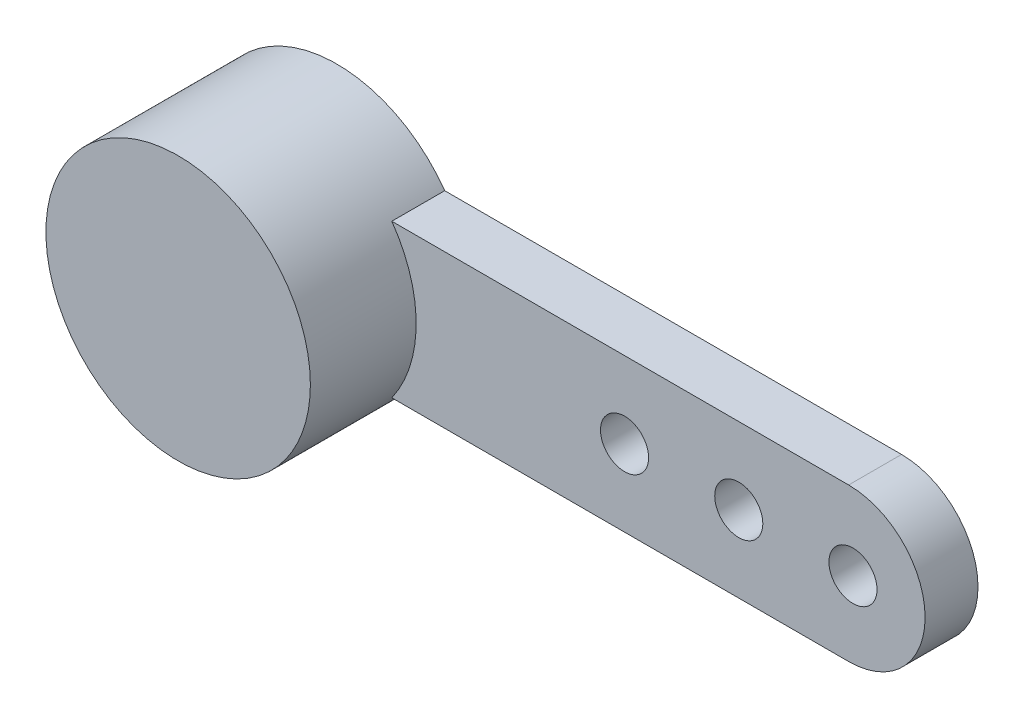
ISO-10303-21;
HEADER;
FILE_DESCRIPTION(('STEP AP214'),'2;1');
FILE_NAME('part.step','',(''),(''),'','','');
FILE_SCHEMA(('AUTOMOTIVE_DESIGN { 1 0 10303 214 1 1 1 1 }'));
ENDSEC;
DATA;
#1=APPLICATION_CONTEXT('core data for automotive mechanical design processes');
#2=APPLICATION_PROTOCOL_DEFINITION('international standard','automotive_design',2000,#1);
#3=PRODUCT_CONTEXT('',#1,'mechanical');
#4=PRODUCT('Part','Part','',(#3));
#5=PRODUCT_RELATED_PRODUCT_CATEGORY('part','',(#4));
#6=PRODUCT_DEFINITION_FORMATION('','',#4);
#7=PRODUCT_DEFINITION_CONTEXT('part definition',#1,'design');
#8=PRODUCT_DEFINITION('design','',#6,#7);
#9=PRODUCT_DEFINITION_SHAPE('','',#8);
#10=(LENGTH_UNIT() NAMED_UNIT(*) SI_UNIT(.MILLI.,.METRE.));
#11=(NAMED_UNIT(*) PLANE_ANGLE_UNIT() SI_UNIT($,.RADIAN.));
#12=(NAMED_UNIT(*) SI_UNIT($,.STERADIAN.) SOLID_ANGLE_UNIT());
#13=UNCERTAINTY_MEASURE_WITH_UNIT(LENGTH_MEASURE(1.E-05),#10,'distance_accuracy_value','');
#14=(GEOMETRIC_REPRESENTATION_CONTEXT(3) GLOBAL_UNCERTAINTY_ASSIGNED_CONTEXT((#13)) GLOBAL_UNIT_ASSIGNED_CONTEXT((#10,
#11,#12)) REPRESENTATION_CONTEXT('',''));
#15=CARTESIAN_POINT('',(0.,0.,0.));
#16=DIRECTION('',(0.,0.,1.));
#17=DIRECTION('',(1.,0.,0.));
#18=AXIS2_PLACEMENT_3D('',#15,#16,#17);
#19=CARTESIAN_POINT('',(0.,0.,1.1));
#20=DIRECTION('',(0.,0.,-1.));
#21=DIRECTION('',(-1.,0.,0.));
#22=AXIS2_PLACEMENT_3D('',#19,#20,#21);
#23=CYLINDRICAL_SURFACE('',#22,2.75);
#24=CARTESIAN_POINT('',(0.,0.,0.));
#25=DIRECTION('',(0.,0.,1.));
#26=DIRECTION('',(1.,0.,0.));
#27=AXIS2_PLACEMENT_3D('',#24,#25,#26);
#28=CIRCLE('',#27,2.75);
#29=CARTESIAN_POINT('',(2.24374686629308,1.59,0.));
#30=VERTEX_POINT('',#29);
#31=CARTESIAN_POINT('',(2.24374686629307,-1.59,0.));
#32=VERTEX_POINT('',#31);
#33=EDGE_CURVE('E95',#30,#32,#28,.T.);
#34=ORIENTED_EDGE('',*,*,#33,.T.);
#35=DIRECTION('',(0.,0.,-1.));
#36=VECTOR('',#35,1.);
#37=CARTESIAN_POINT('',(2.24374686629307,-1.59,1.1));
#38=LINE('',#37,#36);
#39=CARTESIAN_POINT('',(2.24374686629307,-1.59,1.1));
#40=VERTEX_POINT('',#39);
#41=EDGE_CURVE('E44',#40,#32,#38,.T.);
#42=ORIENTED_EDGE('',*,*,#41,.F.);
#43=CARTESIAN_POINT('',(0.,0.,1.1));
#44=DIRECTION('',(0.,0.,1.));
#45=DIRECTION('',(1.,0.,0.));
#46=AXIS2_PLACEMENT_3D('',#43,#44,#45);
#47=CIRCLE('',#46,2.75);
#48=CARTESIAN_POINT('',(2.24374686629308,1.59,1.1));
#49=VERTEX_POINT('',#48);
#50=EDGE_CURVE('E11',#40,#49,#47,.T.);
#51=ORIENTED_EDGE('',*,*,#50,.T.);
#52=DIRECTION('',(0.,0.,-1.));
#53=VECTOR('',#52,1.);
#54=CARTESIAN_POINT('',(2.24374686629308,1.59,1.1));
#55=LINE('',#54,#53);
#56=EDGE_CURVE('E82',#49,#30,#55,.T.);
#57=ORIENTED_EDGE('',*,*,#56,.T.);
#58=EDGE_LOOP('',(#34,#42,#51,#57));
#59=FACE_BOUND('',#58,.T.);
#60=CARTESIAN_POINT('',(0.,0.,3.3));
#61=DIRECTION('',(0.,0.,1.));
#62=DIRECTION('',(1.,0.,0.));
#63=AXIS2_PLACEMENT_3D('',#60,#61,#62);
#64=CIRCLE('',#63,2.75);
#65=CARTESIAN_POINT('',(2.75,0.,3.3));
#66=VERTEX_POINT('',#65);
#67=EDGE_CURVE('E116',#66,#66,#64,.T.);
#68=ORIENTED_EDGE('',*,*,#67,.F.);
#69=EDGE_LOOP('',(#68));
#70=FACE_BOUND('',#69,.T.);
#71=ADVANCED_FACE('F35',(#59,#70),#23,.T.);
#72=CARTESIAN_POINT('',(11.7437468662931,-1.59,1.1));
#73=DIRECTION('',(0.,1.,0.));
#74=DIRECTION('',(-1.,0.,0.));
#75=AXIS2_PLACEMENT_3D('',#72,#73,#74);
#76=PLANE('',#75);
#77=DIRECTION('',(1.,0.,0.));
#78=VECTOR('',#77,1.);
#79=CARTESIAN_POINT('',(11.7437468662931,-1.59,0.));
#80=LINE('',#79,#78);
#81=CARTESIAN_POINT('',(11.7437468662931,-1.59,0.));
#82=VERTEX_POINT('',#81);
#83=EDGE_CURVE('E113',#32,#82,#80,.T.);
#84=ORIENTED_EDGE('',*,*,#83,.T.);
#85=DIRECTION('',(0.,0.,-1.));
#86=VECTOR('',#85,1.);
#87=CARTESIAN_POINT('',(11.7437468662931,-1.59,1.1));
#88=LINE('',#87,#86);
#89=CARTESIAN_POINT('',(11.7437468662931,-1.59,1.1));
#90=VERTEX_POINT('',#89);
#91=EDGE_CURVE('E97',#90,#82,#88,.T.);
#92=ORIENTED_EDGE('',*,*,#91,.F.);
#93=DIRECTION('',(1.,0.,0.));
#94=VECTOR('',#93,1.);
#95=CARTESIAN_POINT('',(11.7437468662931,-1.59,1.1));
#96=LINE('',#95,#94);
#97=EDGE_CURVE('E102',#40,#90,#96,.T.);
#98=ORIENTED_EDGE('',*,*,#97,.F.);
#99=ORIENTED_EDGE('',*,*,#41,.T.);
#100=EDGE_LOOP('',(#84,#92,#98,#99));
#101=FACE_BOUND('',#100,.T.);
#102=ADVANCED_FACE('F151',(#101),#76,.F.);
#103=CARTESIAN_POINT('',(11.7437468662931,0.,1.1));
#104=DIRECTION('',(0.,0.,-1.));
#105=DIRECTION('',(-1.,0.,0.));
#106=AXIS2_PLACEMENT_3D('',#103,#104,#105);
#107=CYLINDRICAL_SURFACE('',#106,1.59);
#108=CARTESIAN_POINT('',(11.7437468662931,0.,0.));
#109=DIRECTION('',(0.,0.,1.));
#110=DIRECTION('',(-1.,0.,0.));
#111=AXIS2_PLACEMENT_3D('',#108,#109,#110);
#112=CIRCLE('',#111,1.59);
#113=CARTESIAN_POINT('',(11.7437468662931,1.59,0.));
#114=VERTEX_POINT('',#113);
#115=EDGE_CURVE('E70',#82,#114,#112,.T.);
#116=ORIENTED_EDGE('',*,*,#115,.T.);
#117=DIRECTION('',(0.,0.,-1.));
#118=VECTOR('',#117,1.);
#119=CARTESIAN_POINT('',(11.7437468662931,1.59,1.1));
#120=LINE('',#119,#118);
#121=CARTESIAN_POINT('',(11.7437468662931,1.59,1.1));
#122=VERTEX_POINT('',#121);
#123=EDGE_CURVE('E88',#122,#114,#120,.T.);
#124=ORIENTED_EDGE('',*,*,#123,.F.);
#125=CARTESIAN_POINT('',(11.7437468662931,0.,1.1));
#126=DIRECTION('',(0.,0.,1.));
#127=DIRECTION('',(-1.,0.,0.));
#128=AXIS2_PLACEMENT_3D('',#125,#126,#127);
#129=CIRCLE('',#128,1.59);
#130=EDGE_CURVE('E53',#90,#122,#129,.T.);
#131=ORIENTED_EDGE('',*,*,#130,.F.);
#132=ORIENTED_EDGE('',*,*,#91,.T.);
#133=EDGE_LOOP('',(#116,#124,#131,#132));
#134=FACE_BOUND('',#133,.T.);
#135=ADVANCED_FACE('F152',(#134),#107,.T.);
#136=CARTESIAN_POINT('',(2.24374686629308,1.59,1.1));
#137=DIRECTION('',(0.,-1.,0.));
#138=DIRECTION('',(1.,0.,0.));
#139=AXIS2_PLACEMENT_3D('',#136,#137,#138);
#140=PLANE('',#139);
#141=DIRECTION('',(-1.,0.,0.));
#142=VECTOR('',#141,1.);
#143=CARTESIAN_POINT('',(2.24374686629308,1.59,0.));
#144=LINE('',#143,#142);
#145=EDGE_CURVE('E76',#114,#30,#144,.T.);
#146=ORIENTED_EDGE('',*,*,#145,.T.);
#147=ORIENTED_EDGE('',*,*,#56,.F.);
#148=DIRECTION('',(-1.,0.,0.));
#149=VECTOR('',#148,1.);
#150=CARTESIAN_POINT('',(2.24374686629308,1.59,1.1));
#151=LINE('',#150,#149);
#152=EDGE_CURVE('E84',#122,#49,#151,.T.);
#153=ORIENTED_EDGE('',*,*,#152,.F.);
#154=ORIENTED_EDGE('',*,*,#123,.T.);
#155=EDGE_LOOP('',(#146,#147,#153,#154));
#156=FACE_BOUND('',#155,.T.);
#157=ADVANCED_FACE('F83',(#156),#140,.F.);
#158=CARTESIAN_POINT('',(0.,0.,1.1));
#159=DIRECTION('',(0.,0.,1.));
#160=DIRECTION('',(1.,0.,0.));
#161=AXIS2_PLACEMENT_3D('',#158,#159,#160);
#162=PLANE('',#161);
#163=CARTESIAN_POINT('',(7.08374686629308,0.,1.1));
#164=DIRECTION('',(0.,0.,1.));
#165=DIRECTION('',(1.,0.,0.));
#166=AXIS2_PLACEMENT_3D('',#163,#164,#165);
#167=CIRCLE('',#166,0.500000000000001);
#168=CARTESIAN_POINT('',(7.58374686629308,0.,1.1));
#169=VERTEX_POINT('',#168);
#170=EDGE_CURVE('E133',#169,#169,#167,.F.);
#171=ORIENTED_EDGE('',*,*,#170,.T.);
#172=EDGE_LOOP('',(#171));
#173=FACE_BOUND('',#172,.T.);
#174=CARTESIAN_POINT('',(9.45874686629308,0.,1.1));
#175=DIRECTION('',(0.,0.,1.));
#176=DIRECTION('',(1.,0.,0.));
#177=AXIS2_PLACEMENT_3D('',#174,#175,#176);
#178=CIRCLE('',#177,0.500000000000001);
#179=CARTESIAN_POINT('',(9.95874686629308,0.,1.1));
#180=VERTEX_POINT('',#179);
#181=EDGE_CURVE('E127',#180,#180,#178,.F.);
#182=ORIENTED_EDGE('',*,*,#181,.T.);
#183=EDGE_LOOP('',(#182));
#184=FACE_BOUND('',#183,.T.);
#185=CARTESIAN_POINT('',(11.8337468662931,0.,1.1));
#186=DIRECTION('',(0.,0.,1.));
#187=DIRECTION('',(1.,0.,0.));
#188=AXIS2_PLACEMENT_3D('',#185,#186,#187);
#189=CIRCLE('',#188,0.500000000000001);
#190=CARTESIAN_POINT('',(12.3337468662931,0.,1.1));
#191=VERTEX_POINT('',#190);
#192=EDGE_CURVE('E121',#191,#191,#189,.F.);
#193=ORIENTED_EDGE('',*,*,#192,.T.);
#194=EDGE_LOOP('',(#193));
#195=FACE_BOUND('',#194,.T.);
#196=ORIENTED_EDGE('',*,*,#50,.F.);
#197=ORIENTED_EDGE('',*,*,#97,.T.);
#198=ORIENTED_EDGE('',*,*,#130,.T.);
#199=ORIENTED_EDGE('',*,*,#152,.T.);
#200=EDGE_LOOP('',(#196,#197,#198,#199));
#201=FACE_BOUND('',#200,.T.);
#202=ADVANCED_FACE('F90',(#173,#184,#195,#201),#162,.T.);
#203=CARTESIAN_POINT('',(0.,0.,0.));
#204=DIRECTION('',(0.,0.,1.));
#205=DIRECTION('',(1.,0.,0.));
#206=AXIS2_PLACEMENT_3D('',#203,#204,#205);
#207=PLANE('',#206);
#208=CARTESIAN_POINT('',(7.08374686629308,0.,0.));
#209=DIRECTION('',(0.,0.,-1.));
#210=DIRECTION('',(-1.,0.,0.));
#211=AXIS2_PLACEMENT_3D('',#208,#209,#210);
#212=CIRCLE('',#211,0.500000000000001);
#213=CARTESIAN_POINT('',(6.58374686629308,0.,0.));
#214=VERTEX_POINT('',#213);
#215=EDGE_CURVE('E130',#214,#214,#212,.T.);
#216=ORIENTED_EDGE('',*,*,#215,.F.);
#217=EDGE_LOOP('',(#216));
#218=FACE_BOUND('',#217,.T.);
#219=CARTESIAN_POINT('',(9.45874686629308,0.,0.));
#220=DIRECTION('',(0.,0.,-1.));
#221=DIRECTION('',(-1.,0.,0.));
#222=AXIS2_PLACEMENT_3D('',#219,#220,#221);
#223=CIRCLE('',#222,0.500000000000001);
#224=CARTESIAN_POINT('',(8.95874686629308,0.,0.));
#225=VERTEX_POINT('',#224);
#226=EDGE_CURVE('E124',#225,#225,#223,.T.);
#227=ORIENTED_EDGE('',*,*,#226,.F.);
#228=EDGE_LOOP('',(#227));
#229=FACE_BOUND('',#228,.T.);
#230=CARTESIAN_POINT('',(11.8337468662931,0.,0.));
#231=DIRECTION('',(0.,0.,-1.));
#232=DIRECTION('',(-1.,0.,0.));
#233=AXIS2_PLACEMENT_3D('',#230,#231,#232);
#234=CIRCLE('',#233,0.500000000000001);
#235=CARTESIAN_POINT('',(11.3337468662931,0.,0.));
#236=VERTEX_POINT('',#235);
#237=EDGE_CURVE('E120',#236,#236,#234,.T.);
#238=ORIENTED_EDGE('',*,*,#237,.F.);
#239=EDGE_LOOP('',(#238));
#240=FACE_BOUND('',#239,.T.);
#241=ORIENTED_EDGE('',*,*,#33,.F.);
#242=ORIENTED_EDGE('',*,*,#145,.F.);
#243=ORIENTED_EDGE('',*,*,#115,.F.);
#244=ORIENTED_EDGE('',*,*,#83,.F.);
#245=EDGE_LOOP('',(#241,#242,#243,#244));
#246=FACE_BOUND('',#245,.T.);
#247=ADVANCED_FACE('F141',(#218,#229,#240,#246),#207,.F.);
#248=CARTESIAN_POINT('',(0.,0.,3.3));
#249=DIRECTION('',(0.,0.,1.));
#250=DIRECTION('',(1.,0.,0.));
#251=AXIS2_PLACEMENT_3D('',#248,#249,#250);
#252=PLANE('',#251);
#253=ORIENTED_EDGE('',*,*,#67,.T.);
#254=EDGE_LOOP('',(#253));
#255=FACE_BOUND('',#254,.T.);
#256=ADVANCED_FACE('F144',(#255),#252,.T.);
#257=CARTESIAN_POINT('',(11.8337468662931,0.,3.301));
#258=DIRECTION('',(0.,0.,-1.));
#259=DIRECTION('',(-1.,0.,0.));
#260=AXIS2_PLACEMENT_3D('',#257,#258,#259);
#261=CYLINDRICAL_SURFACE('',#260,0.500000000000001);
#262=ORIENTED_EDGE('',*,*,#192,.F.);
#263=EDGE_LOOP('',(#262));
#264=FACE_BOUND('',#263,.T.);
#265=ORIENTED_EDGE('',*,*,#237,.T.);
#266=EDGE_LOOP('',(#265));
#267=FACE_BOUND('',#266,.T.);
#268=ADVANCED_FACE('F186',(#264,#267),#261,.F.);
#269=CARTESIAN_POINT('',(9.45874686629308,0.,3.301));
#270=DIRECTION('',(0.,0.,-1.));
#271=DIRECTION('',(-1.,0.,0.));
#272=AXIS2_PLACEMENT_3D('',#269,#270,#271);
#273=CYLINDRICAL_SURFACE('',#272,0.500000000000001);
#274=ORIENTED_EDGE('',*,*,#181,.F.);
#275=EDGE_LOOP('',(#274));
#276=FACE_BOUND('',#275,.T.);
#277=ORIENTED_EDGE('',*,*,#226,.T.);
#278=EDGE_LOOP('',(#277));
#279=FACE_BOUND('',#278,.T.);
#280=ADVANCED_FACE('F209',(#276,#279),#273,.F.);
#281=CARTESIAN_POINT('',(7.08374686629308,0.,3.301));
#282=DIRECTION('',(0.,0.,-1.));
#283=DIRECTION('',(-1.,0.,0.));
#284=AXIS2_PLACEMENT_3D('',#281,#282,#283);
#285=CYLINDRICAL_SURFACE('',#284,0.500000000000001);
#286=ORIENTED_EDGE('',*,*,#170,.F.);
#287=EDGE_LOOP('',(#286));
#288=FACE_BOUND('',#287,.T.);
#289=ORIENTED_EDGE('',*,*,#215,.T.);
#290=EDGE_LOOP('',(#289));
#291=FACE_BOUND('',#290,.T.);
#292=ADVANCED_FACE('F139',(#288,#291),#285,.F.);
#293=CLOSED_SHELL('',(#71,#102,#135,#157,#202,#247,#256,#268,#280,#292));
#294=MANIFOLD_SOLID_BREP('B2',#293);
#295=ADVANCED_BREP_SHAPE_REPRESENTATION('',(#18,#294),#14);
#296=SHAPE_DEFINITION_REPRESENTATION(#9,#295);
ENDSEC;
END-ISO-10303-21;
